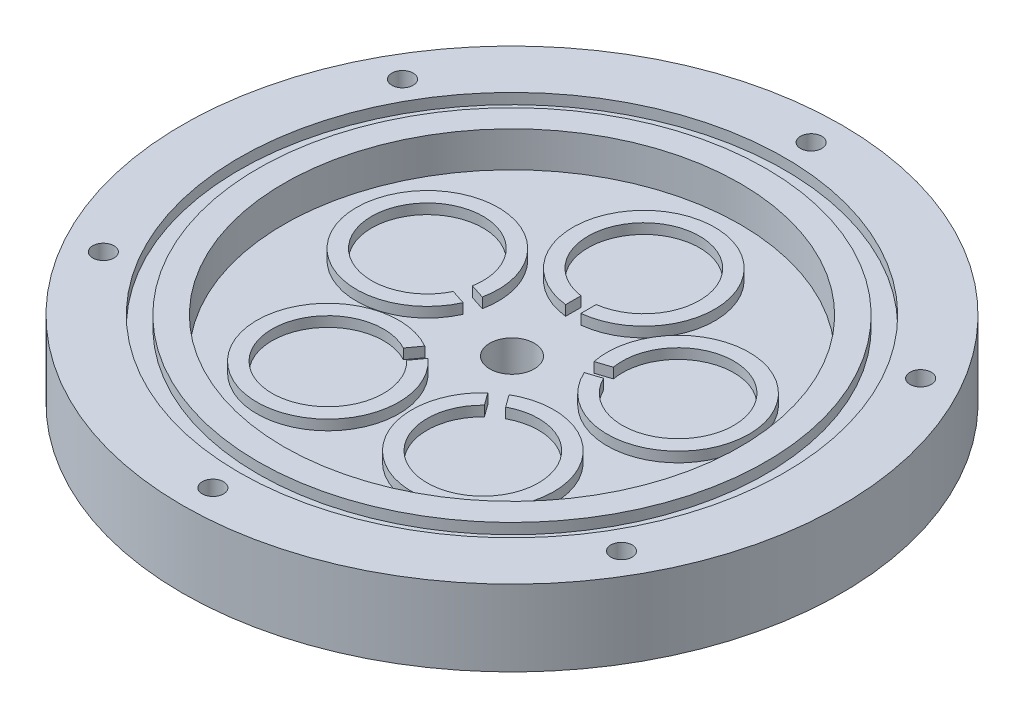
ISO-10303-21;
HEADER;
FILE_DESCRIPTION(('STEP AP214'),'2;1');
FILE_NAME('part.step','',(''),(''),'','','');
FILE_SCHEMA(('AUTOMOTIVE_DESIGN { 1 0 10303 214 1 1 1 1 }'));
ENDSEC;
DATA;
#1=APPLICATION_CONTEXT('core data for automotive mechanical design processes');
#2=APPLICATION_PROTOCOL_DEFINITION('international standard','automotive_design',2000,#1);
#3=PRODUCT_CONTEXT('',#1,'mechanical');
#4=PRODUCT('Part','Part','',(#3));
#5=PRODUCT_RELATED_PRODUCT_CATEGORY('part','',(#4));
#6=PRODUCT_DEFINITION_FORMATION('','',#4);
#7=PRODUCT_DEFINITION_CONTEXT('part definition',#1,'design');
#8=PRODUCT_DEFINITION('design','',#6,#7);
#9=PRODUCT_DEFINITION_SHAPE('','',#8);
#10=(LENGTH_UNIT() NAMED_UNIT(*) SI_UNIT(.MILLI.,.METRE.));
#11=(NAMED_UNIT(*) PLANE_ANGLE_UNIT() SI_UNIT($,.RADIAN.));
#12=(NAMED_UNIT(*) SI_UNIT($,.STERADIAN.) SOLID_ANGLE_UNIT());
#13=UNCERTAINTY_MEASURE_WITH_UNIT(LENGTH_MEASURE(1.E-05),#10,'distance_accuracy_value','');
#14=(GEOMETRIC_REPRESENTATION_CONTEXT(3) GLOBAL_UNCERTAINTY_ASSIGNED_CONTEXT((#13)) GLOBAL_UNIT_ASSIGNED_CONTEXT((#10,
#11,#12)) REPRESENTATION_CONTEXT('',''));
#15=CARTESIAN_POINT('',(0.,0.,0.));
#16=DIRECTION('',(0.,0.,1.));
#17=DIRECTION('',(1.,0.,0.));
#18=AXIS2_PLACEMENT_3D('',#15,#16,#17);
#19=CARTESIAN_POINT('',(0.,0.,0.));
#20=DIRECTION('',(0.,1.,0.));
#21=DIRECTION('',(0.,0.,1.));
#22=AXIS2_PLACEMENT_3D('',#19,#20,#21);
#23=PLANE('',#22);
#24=CARTESIAN_POINT('',(0.,0.,0.));
#25=DIRECTION('',(0.,1.,0.));
#26=DIRECTION('',(0.,0.,1.));
#27=AXIS2_PLACEMENT_3D('',#24,#25,#26);
#28=CIRCLE('',#27,50.095);
#29=CARTESIAN_POINT('',(0.,0.,50.095));
#30=VERTEX_POINT('',#29);
#31=EDGE_CURVE('E83',#30,#30,#28,.T.);
#32=ORIENTED_EDGE('',*,*,#31,.T.);
#33=EDGE_LOOP('',(#32));
#34=FACE_BOUND('',#33,.T.);
#35=CARTESIAN_POINT('',(0.,0.,0.));
#36=DIRECTION('',(0.,1.,0.));
#37=DIRECTION('',(0.,0.,1.));
#38=AXIS2_PLACEMENT_3D('',#35,#36,#37);
#39=CIRCLE('',#38,45.);
#40=CARTESIAN_POINT('',(0.,0.,45.));
#41=VERTEX_POINT('',#40);
#42=EDGE_CURVE('E352',#41,#41,#39,.T.);
#43=ORIENTED_EDGE('',*,*,#42,.F.);
#44=EDGE_LOOP('',(#43));
#45=FACE_BOUND('',#44,.T.);
#46=ADVANCED_FACE('F79',(#34,#45),#23,.T.);
#47=CARTESIAN_POINT('',(24.727469423674,-5.,-8.03444185374856));
#48=DIRECTION('',(0.,1.,0.));
#49=DIRECTION('',(-0.951056516295155,0.,0.309016994374945));
#50=AXIS2_PLACEMENT_3D('',#47,#48,#49);
#51=PLANE('',#50);
#52=CARTESIAN_POINT('',(24.727469423674,-5.,-8.03444185374856));
#53=DIRECTION('',(0.,1.,0.));
#54=DIRECTION('',(-0.951056516295155,0.,0.309016994374945));
#55=AXIS2_PLACEMENT_3D('',#52,#53,#54);
#56=CIRCLE('',#55,14.);
#57=CARTESIAN_POINT('',(11.9528484690729,-5.,-2.30652255733168));
#58=VERTEX_POINT('',#57);
#59=CARTESIAN_POINT('',(11.025797485948,-5.,-5.15969210621714));
#60=VERTEX_POINT('',#59);
#61=EDGE_CURVE('E300',#58,#60,#56,.T.);
#62=ORIENTED_EDGE('',*,*,#61,.T.);
#63=DIRECTION('',(0.951056516295154,0.,-0.309016994374945));
#64=VECTOR('',#63,1.);
#65=CARTESIAN_POINT('',(24.2639439321116,-5.,-9.4610266281913));
#66=LINE('',#65,#64);
#67=CARTESIAN_POINT('',(13.9000458217955,-5.,-6.09359200239864));
#68=VERTEX_POINT('',#67);
#69=EDGE_CURVE('E497',#60,#68,#66,.T.);
#70=ORIENTED_EDGE('',*,*,#69,.T.);
#71=CARTESIAN_POINT('',(24.727469423674,-5.,-8.03444185374856));
#72=DIRECTION('',(0.,1.,0.));
#73=DIRECTION('',(-0.951056516295155,0.,0.309016994374945));
#74=AXIS2_PLACEMENT_3D('',#71,#72,#73);
#75=CIRCLE('',#74,11.);
#76=CARTESIAN_POINT('',(14.8270968049204,-5.,-3.24042245351318));
#77=VERTEX_POINT('',#76);
#78=EDGE_CURVE('E307',#77,#68,#75,.T.);
#79=ORIENTED_EDGE('',*,*,#78,.F.);
#80=DIRECTION('',(-0.951056516295154,0.,0.309016994374945));
#81=VECTOR('',#80,1.);
#82=CARTESIAN_POINT('',(25.1909949152364,-5.,-6.60785707930583));
#83=LINE('',#82,#81);
#84=EDGE_CURVE('E530',#77,#58,#83,.T.);
#85=ORIENTED_EDGE('',*,*,#84,.T.);
#86=EDGE_LOOP('',(#62,#70,#79,#85));
#87=FACE_BOUND('',#86,.T.);
#88=ADVANCED_FACE('F697',(#87),#51,.T.);
#89=CARTESIAN_POINT('',(24.727469423674,-5.,-8.03444185374856));
#90=DIRECTION('',(0.,-1.,0.));
#91=DIRECTION('',(0.,0.,-1.));
#92=AXIS2_PLACEMENT_3D('',#89,#90,#91);
#93=CYLINDRICAL_SURFACE('',#92,14.);
#94=DIRECTION('',(0.,-1.,0.));
#95=VECTOR('',#94,1.);
#96=CARTESIAN_POINT('',(11.025797485948,-5.,-5.15969210621714));
#97=LINE('',#96,#95);
#98=CARTESIAN_POINT('',(11.025797485948,-7.,-5.15969210621714));
#99=VERTEX_POINT('',#98);
#100=EDGE_CURVE('E261',#60,#99,#97,.T.);
#101=ORIENTED_EDGE('',*,*,#100,.F.);
#102=ORIENTED_EDGE('',*,*,#61,.F.);
#103=DIRECTION('',(0.,-1.,0.));
#104=VECTOR('',#103,1.);
#105=CARTESIAN_POINT('',(11.9528484690729,-5.,-2.30652255733168));
#106=LINE('',#105,#104);
#107=CARTESIAN_POINT('',(11.9528484690729,-7.,-2.30652255733167));
#108=VERTEX_POINT('',#107);
#109=EDGE_CURVE('E532',#108,#58,#106,.F.);
#110=ORIENTED_EDGE('',*,*,#109,.F.);
#111=CARTESIAN_POINT('',(24.727469423674,-7.,-8.03444185374856));
#112=DIRECTION('',(0.,1.,0.));
#113=DIRECTION('',(-0.951056516295155,0.,0.309016994374945));
#114=AXIS2_PLACEMENT_3D('',#111,#112,#113);
#115=CIRCLE('',#114,14.);
#116=EDGE_CURVE('E306',#108,#99,#115,.T.);
#117=ORIENTED_EDGE('',*,*,#116,.T.);
#118=EDGE_LOOP('',(#101,#102,#110,#117));
#119=FACE_BOUND('',#118,.T.);
#120=ADVANCED_FACE('F702',(#119),#93,.T.);
#121=CARTESIAN_POINT('',(24.727469423674,-5.,-8.03444185374856));
#122=DIRECTION('',(0.,-1.,0.));
#123=DIRECTION('',(0.,0.,-1.));
#124=AXIS2_PLACEMENT_3D('',#121,#122,#123);
#125=CYLINDRICAL_SURFACE('',#124,11.);
#126=ORIENTED_EDGE('',*,*,#78,.T.);
#127=DIRECTION('',(0.,-1.,0.));
#128=VECTOR('',#127,1.);
#129=CARTESIAN_POINT('',(13.9000458217955,-5.,-6.09359200239864));
#130=LINE('',#129,#128);
#131=CARTESIAN_POINT('',(13.9000458217955,-7.,-6.09359200239864));
#132=VERTEX_POINT('',#131);
#133=EDGE_CURVE('E527',#68,#132,#130,.T.);
#134=ORIENTED_EDGE('',*,*,#133,.T.);
#135=CARTESIAN_POINT('',(24.727469423674,-7.,-8.03444185374856));
#136=DIRECTION('',(0.,1.,0.));
#137=DIRECTION('',(0.,0.,1.));
#138=AXIS2_PLACEMENT_3D('',#135,#136,#137);
#139=CIRCLE('',#138,11.);
#140=CARTESIAN_POINT('',(14.8270968049204,-7.,-3.24042245351318));
#141=VERTEX_POINT('',#140);
#142=EDGE_CURVE('E523',#132,#141,#139,.F.);
#143=ORIENTED_EDGE('',*,*,#142,.T.);
#144=DIRECTION('',(0.,-1.,0.));
#145=VECTOR('',#144,1.);
#146=CARTESIAN_POINT('',(14.8270968049204,-5.,-3.24042245351318));
#147=LINE('',#146,#145);
#148=EDGE_CURVE('E485',#141,#77,#147,.F.);
#149=ORIENTED_EDGE('',*,*,#148,.T.);
#150=EDGE_LOOP('',(#126,#134,#143,#149));
#151=FACE_BOUND('',#150,.T.);
#152=ADVANCED_FACE('F764',(#151),#125,.F.);
#153=CARTESIAN_POINT('',(15.2824165596042,-5.,21.0344418537487));
#154=DIRECTION('',(0.,1.,0.));
#155=DIRECTION('',(-0.587785252292469,0.,-0.809016994374951));
#156=AXIS2_PLACEMENT_3D('',#153,#154,#155);
#157=PLANE('',#156);
#158=CARTESIAN_POINT('',(15.2824165596042,-5.,21.0344418537487));
#159=DIRECTION('',(0.,1.,0.));
#160=DIRECTION('',(-0.587785252292469,0.,-0.809016994374951));
#161=AXIS2_PLACEMENT_3D('',#158,#159,#160);
#162=CIRCLE('',#161,14.);
#163=CARTESIAN_POINT('',(5.8872666162641,-5.,10.6550797566757));
#164=VERTEX_POINT('',#163);
#165=CARTESIAN_POINT('',(8.31431759938896,-5.,8.89172399979824));
#166=VERTEX_POINT('',#165);
#167=EDGE_CURVE('E459',#164,#166,#162,.T.);
#168=ORIENTED_EDGE('',*,*,#167,.T.);
#169=DIRECTION('',(0.587785252292469,0.,0.809016994374951));
#170=VECTOR('',#169,1.);
#171=CARTESIAN_POINT('',(16.4959420511666,-5.,20.15276397531));
#172=LINE('',#171,#170);
#173=CARTESIAN_POINT('',(10.0907007630505,-5.,11.3367056700915));
#174=VERTEX_POINT('',#173);
#175=EDGE_CURVE('E472',#166,#174,#172,.T.);
#176=ORIENTED_EDGE('',*,*,#175,.T.);
#177=CARTESIAN_POINT('',(15.2824165596042,-5.,21.0344418537487));
#178=DIRECTION('',(0.,1.,0.));
#179=DIRECTION('',(-0.587785252292469,0.,-0.809016994374951));
#180=AXIS2_PLACEMENT_3D('',#177,#178,#179);
#181=CIRCLE('',#180,11.);
#182=CARTESIAN_POINT('',(7.66364977992568,-5.,13.1000614269689));
#183=VERTEX_POINT('',#182);
#184=EDGE_CURVE('E460',#183,#174,#181,.T.);
#185=ORIENTED_EDGE('',*,*,#184,.F.);
#186=DIRECTION('',(-0.587785252292469,0.,-0.809016994374951));
#187=VECTOR('',#186,1.);
#188=CARTESIAN_POINT('',(14.0688910680418,-5.,21.9161197321874));
#189=LINE('',#188,#187);
#190=EDGE_CURVE('E582',#183,#164,#189,.T.);
#191=ORIENTED_EDGE('',*,*,#190,.T.);
#192=EDGE_LOOP('',(#168,#176,#185,#191));
#193=FACE_BOUND('',#192,.T.);
#194=ADVANCED_FACE('F635',(#193),#157,.T.);
#195=CARTESIAN_POINT('',(15.2824165596042,-5.,21.0344418537487));
#196=DIRECTION('',(0.,-1.,0.));
#197=DIRECTION('',(0.,0.,-1.));
#198=AXIS2_PLACEMENT_3D('',#195,#196,#197);
#199=CYLINDRICAL_SURFACE('',#198,14.);
#200=DIRECTION('',(0.,-1.,0.));
#201=VECTOR('',#200,1.);
#202=CARTESIAN_POINT('',(8.31431759938896,-5.,8.89172399979825));
#203=LINE('',#202,#201);
#204=CARTESIAN_POINT('',(8.31431759938896,-7.,8.89172399979825));
#205=VERTEX_POINT('',#204);
#206=EDGE_CURVE('E478',#166,#205,#203,.T.);
#207=ORIENTED_EDGE('',*,*,#206,.F.);
#208=ORIENTED_EDGE('',*,*,#167,.F.);
#209=DIRECTION('',(0.,-1.,0.));
#210=VECTOR('',#209,1.);
#211=CARTESIAN_POINT('',(5.88726661626411,-5.,10.6550797566757));
#212=LINE('',#211,#210);
#213=CARTESIAN_POINT('',(5.88726661626411,-7.,10.6550797566757));
#214=VERTEX_POINT('',#213);
#215=EDGE_CURVE('E580',#214,#164,#212,.F.);
#216=ORIENTED_EDGE('',*,*,#215,.F.);
#217=CARTESIAN_POINT('',(15.2824165596042,-7.,21.0344418537487));
#218=DIRECTION('',(0.,1.,0.));
#219=DIRECTION('',(-0.587785252292469,0.,-0.809016994374951));
#220=AXIS2_PLACEMENT_3D('',#217,#218,#219);
#221=CIRCLE('',#220,14.);
#222=EDGE_CURVE('E454',#214,#205,#221,.T.);
#223=ORIENTED_EDGE('',*,*,#222,.T.);
#224=EDGE_LOOP('',(#207,#208,#216,#223));
#225=FACE_BOUND('',#224,.T.);
#226=ADVANCED_FACE('F640',(#225),#199,.T.);
#227=CARTESIAN_POINT('',(15.2824165596042,-5.,21.0344418537487));
#228=DIRECTION('',(0.,-1.,0.));
#229=DIRECTION('',(0.,0.,-1.));
#230=AXIS2_PLACEMENT_3D('',#227,#228,#229);
#231=CYLINDRICAL_SURFACE('',#230,11.);
#232=ORIENTED_EDGE('',*,*,#184,.T.);
#233=DIRECTION('',(0.,-1.,0.));
#234=VECTOR('',#233,1.);
#235=CARTESIAN_POINT('',(10.0907007630505,-5.,11.3367056700915));
#236=LINE('',#235,#234);
#237=CARTESIAN_POINT('',(10.0907007630505,-7.,11.3367056700915));
#238=VERTEX_POINT('',#237);
#239=EDGE_CURVE('E479',#174,#238,#236,.T.);
#240=ORIENTED_EDGE('',*,*,#239,.T.);
#241=CARTESIAN_POINT('',(15.2824165596042,-7.,21.0344418537487));
#242=DIRECTION('',(0.,1.,0.));
#243=DIRECTION('',(0.,0.,1.));
#244=AXIS2_PLACEMENT_3D('',#241,#242,#243);
#245=CIRCLE('',#244,11.);
#246=CARTESIAN_POINT('',(7.66364977992568,-7.,13.1000614269689));
#247=VERTEX_POINT('',#246);
#248=EDGE_CURVE('E646',#238,#247,#245,.F.);
#249=ORIENTED_EDGE('',*,*,#248,.T.);
#250=DIRECTION('',(0.,-1.,0.));
#251=VECTOR('',#250,1.);
#252=CARTESIAN_POINT('',(7.66364977992568,-5.,13.1000614269689));
#253=LINE('',#252,#251);
#254=EDGE_CURVE('E583',#247,#183,#253,.F.);
#255=ORIENTED_EDGE('',*,*,#254,.T.);
#256=EDGE_LOOP('',(#232,#240,#249,#255));
#257=FACE_BOUND('',#256,.T.);
#258=ADVANCED_FACE('F772',(#257),#231,.F.);
#259=CARTESIAN_POINT('',(-15.2824165596045,-5.,21.0344418537485));
#260=DIRECTION('',(0.,1.,0.));
#261=DIRECTION('',(0.58778525229248,0.,-0.809016994374942));
#262=AXIS2_PLACEMENT_3D('',#259,#260,#261);
#263=PLANE('',#262);
#264=CARTESIAN_POINT('',(-15.2824165596045,-5.,21.0344418537485));
#265=DIRECTION('',(0.,1.,0.));
#266=DIRECTION('',(0.58778525229248,0.,-0.809016994374942));
#267=AXIS2_PLACEMENT_3D('',#264,#265,#266);
#268=CIRCLE('',#267,14.);
#269=CARTESIAN_POINT('',(-8.31431759938909,-5.,8.89172399979812));
#270=VERTEX_POINT('',#269);
#271=CARTESIAN_POINT('',(-5.88726661626426,-5.,10.6550797566756));
#272=VERTEX_POINT('',#271);
#273=EDGE_CURVE('E608',#270,#272,#268,.T.);
#274=ORIENTED_EDGE('',*,*,#273,.T.);
#275=DIRECTION('',(-0.58778525229248,0.,0.809016994374942));
#276=VECTOR('',#275,1.);
#277=CARTESIAN_POINT('',(-14.0688910680421,-5.,21.9161197321872));
#278=LINE('',#277,#276);
#279=CARTESIAN_POINT('',(-7.66364977992587,-5.,13.1000614269688));
#280=VERTEX_POINT('',#279);
#281=EDGE_CURVE('E589',#272,#280,#278,.T.);
#282=ORIENTED_EDGE('',*,*,#281,.T.);
#283=CARTESIAN_POINT('',(-15.2824165596045,-5.,21.0344418537485));
#284=DIRECTION('',(0.,1.,0.));
#285=DIRECTION('',(0.58778525229248,0.,-0.809016994374942));
#286=AXIS2_PLACEMENT_3D('',#283,#284,#285);
#287=CIRCLE('',#286,11.);
#288=CARTESIAN_POINT('',(-10.0907007630507,-5.,11.3367056700913));
#289=VERTEX_POINT('',#288);
#290=EDGE_CURVE('E257',#289,#280,#287,.T.);
#291=ORIENTED_EDGE('',*,*,#290,.F.);
#292=DIRECTION('',(0.58778525229248,0.,-0.809016994374942));
#293=VECTOR('',#292,1.);
#294=CARTESIAN_POINT('',(-16.4959420511669,-5.,20.1527639753098));
#295=LINE('',#294,#293);
#296=EDGE_CURVE('E441',#289,#270,#295,.T.);
#297=ORIENTED_EDGE('',*,*,#296,.T.);
#298=EDGE_LOOP('',(#274,#282,#291,#297));
#299=FACE_BOUND('',#298,.T.);
#300=ADVANCED_FACE('F606',(#299),#263,.T.);
#301=CARTESIAN_POINT('',(-15.2824165596045,-5.,21.0344418537485));
#302=DIRECTION('',(0.,-1.,0.));
#303=DIRECTION('',(0.,0.,-1.));
#304=AXIS2_PLACEMENT_3D('',#301,#302,#303);
#305=CYLINDRICAL_SURFACE('',#304,14.);
#306=DIRECTION('',(0.,-1.,0.));
#307=VECTOR('',#306,1.);
#308=CARTESIAN_POINT('',(-5.88726661626426,-5.,10.6550797566756));
#309=LINE('',#308,#307);
#310=CARTESIAN_POINT('',(-5.88726661626426,-7.,10.6550797566756));
#311=VERTEX_POINT('',#310);
#312=EDGE_CURVE('E586',#272,#311,#309,.T.);
#313=ORIENTED_EDGE('',*,*,#312,.F.);
#314=ORIENTED_EDGE('',*,*,#273,.F.);
#315=DIRECTION('',(0.,-1.,0.));
#316=VECTOR('',#315,1.);
#317=CARTESIAN_POINT('',(-8.31431759938909,-5.,8.89172399979813));
#318=LINE('',#317,#316);
#319=CARTESIAN_POINT('',(-8.31431759938909,-7.,8.89172399979813));
#320=VERTEX_POINT('',#319);
#321=EDGE_CURVE('E446',#320,#270,#318,.F.);
#322=ORIENTED_EDGE('',*,*,#321,.F.);
#323=CARTESIAN_POINT('',(-15.2824165596045,-7.,21.0344418537485));
#324=DIRECTION('',(0.,1.,0.));
#325=DIRECTION('',(0.58778525229248,0.,-0.809016994374942));
#326=AXIS2_PLACEMENT_3D('',#323,#324,#325);
#327=CIRCLE('',#326,14.);
#328=EDGE_CURVE('E613',#320,#311,#327,.T.);
#329=ORIENTED_EDGE('',*,*,#328,.T.);
#330=EDGE_LOOP('',(#313,#314,#322,#329));
#331=FACE_BOUND('',#330,.T.);
#332=ADVANCED_FACE('F611',(#331),#305,.T.);
#333=CARTESIAN_POINT('',(-15.2824165596045,-5.,21.0344418537485));
#334=DIRECTION('',(0.,-1.,0.));
#335=DIRECTION('',(0.,0.,-1.));
#336=AXIS2_PLACEMENT_3D('',#333,#334,#335);
#337=CYLINDRICAL_SURFACE('',#336,11.);
#338=ORIENTED_EDGE('',*,*,#290,.T.);
#339=DIRECTION('',(0.,-1.,0.));
#340=VECTOR('',#339,1.);
#341=CARTESIAN_POINT('',(-7.66364977992587,-5.,13.1000614269688));
#342=LINE('',#341,#340);
#343=CARTESIAN_POINT('',(-7.66364977992587,-7.,13.1000614269688));
#344=VERTEX_POINT('',#343);
#345=EDGE_CURVE('E591',#280,#344,#342,.T.);
#346=ORIENTED_EDGE('',*,*,#345,.T.);
#347=CARTESIAN_POINT('',(-15.2824165596045,-7.,21.0344418537485));
#348=DIRECTION('',(0.,1.,0.));
#349=DIRECTION('',(0.,0.,1.));
#350=AXIS2_PLACEMENT_3D('',#347,#348,#349);
#351=CIRCLE('',#350,11.);
#352=CARTESIAN_POINT('',(-10.0907007630507,-7.,11.3367056700913));
#353=VERTEX_POINT('',#352);
#354=EDGE_CURVE('E90',#344,#353,#351,.F.);
#355=ORIENTED_EDGE('',*,*,#354,.T.);
#356=DIRECTION('',(0.,-1.,0.));
#357=VECTOR('',#356,1.);
#358=CARTESIAN_POINT('',(-10.0907007630507,-5.,11.3367056700913));
#359=LINE('',#358,#357);
#360=EDGE_CURVE('E435',#353,#289,#359,.F.);
#361=ORIENTED_EDGE('',*,*,#360,.T.);
#362=EDGE_LOOP('',(#338,#346,#355,#361));
#363=FACE_BOUND('',#362,.T.);
#364=ADVANCED_FACE('F662',(#363),#337,.F.);
#365=CARTESIAN_POINT('',(-24.7274694236739,-5.,-8.03444185374891));
#366=DIRECTION('',(0.,1.,0.));
#367=DIRECTION('',(0.95105651629515,0.,0.309016994374958));
#368=AXIS2_PLACEMENT_3D('',#365,#366,#367);
#369=PLANE('',#368);
#370=CARTESIAN_POINT('',(-24.7274694236739,-5.,-8.03444185374891));
#371=DIRECTION('',(0.,1.,0.));
#372=DIRECTION('',(0.95105651629515,0.,0.309016994374958));
#373=AXIS2_PLACEMENT_3D('',#370,#371,#372);
#374=CIRCLE('',#373,14.);
#375=CARTESIAN_POINT('',(-11.0257974859479,-5.,-5.1596921062173));
#376=VERTEX_POINT('',#375);
#377=CARTESIAN_POINT('',(-11.9528484690728,-5.,-2.30652255733185));
#378=VERTEX_POINT('',#377);
#379=EDGE_CURVE('E242',#376,#378,#374,.T.);
#380=ORIENTED_EDGE('',*,*,#379,.T.);
#381=DIRECTION('',(-0.95105651629515,0.,-0.309016994374958));
#382=VECTOR('',#381,1.);
#383=CARTESIAN_POINT('',(-25.1909949152363,-5.,-6.60785707930619));
#384=LINE('',#383,#382);
#385=CARTESIAN_POINT('',(-14.8270968049203,-5.,-3.24042245351339));
#386=VERTEX_POINT('',#385);
#387=EDGE_CURVE('E436',#378,#386,#384,.T.);
#388=ORIENTED_EDGE('',*,*,#387,.T.);
#389=CARTESIAN_POINT('',(-24.7274694236739,-5.,-8.03444185374891));
#390=DIRECTION('',(0.,1.,0.));
#391=DIRECTION('',(0.95105651629515,0.,0.309016994374958));
#392=AXIS2_PLACEMENT_3D('',#389,#390,#391);
#393=CIRCLE('',#392,11.);
#394=CARTESIAN_POINT('',(-13.9000458217955,-5.,-6.09359200239884));
#395=VERTEX_POINT('',#394);
#396=EDGE_CURVE('E252',#395,#386,#393,.T.);
#397=ORIENTED_EDGE('',*,*,#396,.F.);
#398=DIRECTION('',(0.95105651629515,0.,0.309016994374958));
#399=VECTOR('',#398,1.);
#400=CARTESIAN_POINT('',(-24.2639439321115,-5.,-9.46102662819164));
#401=LINE('',#400,#399);
#402=EDGE_CURVE('E245',#395,#376,#401,.T.);
#403=ORIENTED_EDGE('',*,*,#402,.T.);
#404=EDGE_LOOP('',(#380,#388,#397,#403));
#405=FACE_BOUND('',#404,.T.);
#406=ADVANCED_FACE('F517',(#405),#369,.T.);
#407=CARTESIAN_POINT('',(-24.7274694236739,-5.,-8.03444185374891));
#408=DIRECTION('',(0.,-1.,0.));
#409=DIRECTION('',(0.,0.,-1.));
#410=AXIS2_PLACEMENT_3D('',#407,#408,#409);
#411=CYLINDRICAL_SURFACE('',#410,14.);
#412=DIRECTION('',(0.,-1.,0.));
#413=VECTOR('',#412,1.);
#414=CARTESIAN_POINT('',(-11.9528484690728,-5.,-2.30652255733185));
#415=LINE('',#414,#413);
#416=CARTESIAN_POINT('',(-11.9528484690728,-7.,-2.30652255733185));
#417=VERTEX_POINT('',#416);
#418=EDGE_CURVE('E430',#378,#417,#415,.T.);
#419=ORIENTED_EDGE('',*,*,#418,.F.);
#420=ORIENTED_EDGE('',*,*,#379,.F.);
#421=DIRECTION('',(0.,-1.,0.));
#422=VECTOR('',#421,1.);
#423=CARTESIAN_POINT('',(-11.0257974859479,-5.,-5.1596921062173));
#424=LINE('',#423,#422);
#425=CARTESIAN_POINT('',(-11.0257974859479,-7.,-5.1596921062173));
#426=VERTEX_POINT('',#425);
#427=EDGE_CURVE('E224',#426,#376,#424,.F.);
#428=ORIENTED_EDGE('',*,*,#427,.F.);
#429=CARTESIAN_POINT('',(-24.7274694236739,-7.,-8.03444185374891));
#430=DIRECTION('',(0.,1.,0.));
#431=DIRECTION('',(0.95105651629515,0.,0.309016994374958));
#432=AXIS2_PLACEMENT_3D('',#429,#430,#431);
#433=CIRCLE('',#432,14.);
#434=EDGE_CURVE('E240',#426,#417,#433,.T.);
#435=ORIENTED_EDGE('',*,*,#434,.T.);
#436=EDGE_LOOP('',(#419,#420,#428,#435));
#437=FACE_BOUND('',#436,.T.);
#438=ADVANCED_FACE('F239',(#437),#411,.T.);
#439=CARTESIAN_POINT('',(-24.7274694236739,-5.,-8.03444185374891));
#440=DIRECTION('',(0.,-1.,0.));
#441=DIRECTION('',(0.,0.,-1.));
#442=AXIS2_PLACEMENT_3D('',#439,#440,#441);
#443=CYLINDRICAL_SURFACE('',#442,11.);
#444=ORIENTED_EDGE('',*,*,#396,.T.);
#445=DIRECTION('',(0.,-1.,0.));
#446=VECTOR('',#445,1.);
#447=CARTESIAN_POINT('',(-14.8270968049203,-5.,-3.24042245351339));
#448=LINE('',#447,#446);
#449=CARTESIAN_POINT('',(-14.8270968049203,-7.,-3.24042245351339));
#450=VERTEX_POINT('',#449);
#451=EDGE_CURVE('E244',#386,#450,#448,.T.);
#452=ORIENTED_EDGE('',*,*,#451,.T.);
#453=CARTESIAN_POINT('',(-24.7274694236739,-7.,-8.03444185374891));
#454=DIRECTION('',(0.,1.,0.));
#455=DIRECTION('',(0.,0.,1.));
#456=AXIS2_PLACEMENT_3D('',#453,#454,#455);
#457=CIRCLE('',#456,11.);
#458=CARTESIAN_POINT('',(-13.9000458217955,-7.,-6.09359200239884));
#459=VERTEX_POINT('',#458);
#460=EDGE_CURVE('E13',#450,#459,#457,.F.);
#461=ORIENTED_EDGE('',*,*,#460,.T.);
#462=DIRECTION('',(0.,-1.,0.));
#463=VECTOR('',#462,1.);
#464=CARTESIAN_POINT('',(-13.9000458217955,-5.,-6.09359200239884));
#465=LINE('',#464,#463);
#466=EDGE_CURVE('E227',#459,#395,#465,.F.);
#467=ORIENTED_EDGE('',*,*,#466,.T.);
#468=EDGE_LOOP('',(#444,#452,#461,#467));
#469=FACE_BOUND('',#468,.T.);
#470=ADVANCED_FACE('F519',(#469),#443,.F.);
#471=CARTESIAN_POINT('',(0.,-5.,-26.));
#472=DIRECTION('',(0.,1.,0.));
#473=DIRECTION('',(0.,0.,1.));
#474=AXIS2_PLACEMENT_3D('',#471,#472,#473);
#475=PLANE('',#474);
#476=CARTESIAN_POINT('',(0.,-5.,-26.));
#477=DIRECTION('',(0.,1.,0.));
#478=DIRECTION('',(0.,0.,1.));
#479=AXIS2_PLACEMENT_3D('',#476,#477,#478);
#480=CIRCLE('',#479,14.);
#481=CARTESIAN_POINT('',(1.5,-5.,-12.0805890929249));
#482=VERTEX_POINT('',#481);
#483=CARTESIAN_POINT('',(-1.5,-5.,-12.0805890929249));
#484=VERTEX_POINT('',#483);
#485=EDGE_CURVE('E331',#482,#484,#480,.T.);
#486=ORIENTED_EDGE('',*,*,#485,.T.);
#487=DIRECTION('',(0.,0.,-1.));
#488=VECTOR('',#487,1.);
#489=CARTESIAN_POINT('',(-1.5,-5.,-26.));
#490=LINE('',#489,#488);
#491=CARTESIAN_POINT('',(-1.5,-5.,-15.1027526411483));
#492=VERTEX_POINT('',#491);
#493=EDGE_CURVE('E541',#484,#492,#490,.T.);
#494=ORIENTED_EDGE('',*,*,#493,.T.);
#495=CARTESIAN_POINT('',(0.,-5.,-26.));
#496=DIRECTION('',(0.,1.,0.));
#497=DIRECTION('',(0.,0.,1.));
#498=AXIS2_PLACEMENT_3D('',#495,#496,#497);
#499=CIRCLE('',#498,11.);
#500=CARTESIAN_POINT('',(1.5,-5.,-15.1027526411483));
#501=VERTEX_POINT('',#500);
#502=EDGE_CURVE('E338',#501,#492,#499,.T.);
#503=ORIENTED_EDGE('',*,*,#502,.F.);
#504=DIRECTION('',(0.,0.,1.));
#505=VECTOR('',#504,1.);
#506=CARTESIAN_POINT('',(1.5,-5.,-26.));
#507=LINE('',#506,#505);
#508=EDGE_CURVE('E548',#501,#482,#507,.T.);
#509=ORIENTED_EDGE('',*,*,#508,.T.);
#510=EDGE_LOOP('',(#486,#494,#503,#509));
#511=FACE_BOUND('',#510,.T.);
#512=ADVANCED_FACE('F751',(#511),#475,.T.);
#513=CARTESIAN_POINT('',(0.,-5.,-26.));
#514=DIRECTION('',(0.,-1.,0.));
#515=DIRECTION('',(0.,0.,-1.));
#516=AXIS2_PLACEMENT_3D('',#513,#514,#515);
#517=CYLINDRICAL_SURFACE('',#516,14.);
#518=DIRECTION('',(0.,-1.,0.));
#519=VECTOR('',#518,1.);
#520=CARTESIAN_POINT('',(-1.5,-5.,-12.0805890929249));
#521=LINE('',#520,#519);
#522=CARTESIAN_POINT('',(-1.5,-7.,-12.0805890929249));
#523=VERTEX_POINT('',#522);
#524=EDGE_CURVE('E544',#484,#523,#521,.T.);
#525=ORIENTED_EDGE('',*,*,#524,.F.);
#526=ORIENTED_EDGE('',*,*,#485,.F.);
#527=DIRECTION('',(0.,-1.,0.));
#528=VECTOR('',#527,1.);
#529=CARTESIAN_POINT('',(1.5,-5.,-12.0805890929249));
#530=LINE('',#529,#528);
#531=CARTESIAN_POINT('',(1.5,-7.,-12.0805890929249));
#532=VERTEX_POINT('',#531);
#533=EDGE_CURVE('E551',#532,#482,#530,.F.);
#534=ORIENTED_EDGE('',*,*,#533,.F.);
#535=CARTESIAN_POINT('',(0.,-7.,-26.));
#536=DIRECTION('',(0.,1.,0.));
#537=DIRECTION('',(0.,0.,1.));
#538=AXIS2_PLACEMENT_3D('',#535,#536,#537);
#539=CIRCLE('',#538,14.);
#540=EDGE_CURVE('E337',#532,#523,#539,.T.);
#541=ORIENTED_EDGE('',*,*,#540,.T.);
#542=EDGE_LOOP('',(#525,#526,#534,#541));
#543=FACE_BOUND('',#542,.T.);
#544=ADVANCED_FACE('F748',(#543),#517,.T.);
#545=CARTESIAN_POINT('',(0.,-5.,-26.));
#546=DIRECTION('',(0.,-1.,0.));
#547=DIRECTION('',(0.,0.,-1.));
#548=AXIS2_PLACEMENT_3D('',#545,#546,#547);
#549=CYLINDRICAL_SURFACE('',#548,11.);
#550=ORIENTED_EDGE('',*,*,#502,.T.);
#551=DIRECTION('',(0.,-1.,0.));
#552=VECTOR('',#551,1.);
#553=CARTESIAN_POINT('',(-1.5,-5.,-15.1027526411483));
#554=LINE('',#553,#552);
#555=CARTESIAN_POINT('',(-1.5,-7.,-15.1027526411483));
#556=VERTEX_POINT('',#555);
#557=EDGE_CURVE('E545',#492,#556,#554,.T.);
#558=ORIENTED_EDGE('',*,*,#557,.T.);
#559=CARTESIAN_POINT('',(0.,-7.,-26.));
#560=DIRECTION('',(0.,1.,0.));
#561=DIRECTION('',(0.,0.,1.));
#562=AXIS2_PLACEMENT_3D('',#559,#560,#561);
#563=CIRCLE('',#562,11.);
#564=CARTESIAN_POINT('',(1.5,-7.,-15.1027526411483));
#565=VERTEX_POINT('',#564);
#566=EDGE_CURVE('E534',#556,#565,#563,.F.);
#567=ORIENTED_EDGE('',*,*,#566,.T.);
#568=DIRECTION('',(0.,-1.,0.));
#569=VECTOR('',#568,1.);
#570=CARTESIAN_POINT('',(1.5,-5.,-15.1027526411483));
#571=LINE('',#570,#569);
#572=EDGE_CURVE('E539',#565,#501,#571,.F.);
#573=ORIENTED_EDGE('',*,*,#572,.T.);
#574=EDGE_LOOP('',(#550,#558,#567,#573));
#575=FACE_BOUND('',#574,.T.);
#576=ADVANCED_FACE('F712',(#575),#549,.F.);
#577=CARTESIAN_POINT('',(0.,-15.,0.));
#578=DIRECTION('',(0.,1.,0.));
#579=DIRECTION('',(0.,0.,1.));
#580=AXIS2_PLACEMENT_3D('',#577,#578,#579);
#581=CYLINDRICAL_SURFACE('',#580,65.);
#582=CARTESIAN_POINT('',(0.,-15.,0.));
#583=DIRECTION('',(0.,1.,0.));
#584=DIRECTION('',(0.,0.,1.));
#585=AXIS2_PLACEMENT_3D('',#582,#583,#584);
#586=CIRCLE('',#585,65.);
#587=CARTESIAN_POINT('',(0.,-15.,65.));
#588=VERTEX_POINT('',#587);
#589=EDGE_CURVE('E537',#588,#588,#586,.T.);
#590=ORIENTED_EDGE('',*,*,#589,.T.);
#591=EDGE_LOOP('',(#590));
#592=FACE_BOUND('',#591,.T.);
#593=CARTESIAN_POINT('',(0.,0.,0.));
#594=DIRECTION('',(0.,1.,0.));
#595=DIRECTION('',(0.,0.,1.));
#596=AXIS2_PLACEMENT_3D('',#593,#594,#595);
#597=CIRCLE('',#596,65.);
#598=CARTESIAN_POINT('',(0.,0.,65.));
#599=VERTEX_POINT('',#598);
#600=EDGE_CURVE('E561',#599,#599,#597,.T.);
#601=ORIENTED_EDGE('',*,*,#600,.F.);
#602=EDGE_LOOP('',(#601));
#603=FACE_BOUND('',#602,.T.);
#604=ADVANCED_FACE('F81',(#592,#603),#581,.T.);
#605=CARTESIAN_POINT('',(0.,-15.,0.));
#606=DIRECTION('',(0.,1.,0.));
#607=DIRECTION('',(0.,0.,1.));
#608=AXIS2_PLACEMENT_3D('',#605,#606,#607);
#609=PLANE('',#608);
#610=CARTESIAN_POINT('',(-51.0954988232815,-15.,-29.5000000000006));
#611=DIRECTION('',(0.,1.,0.));
#612=DIRECTION('',(0.,0.,1.));
#613=AXIS2_PLACEMENT_3D('',#610,#611,#612);
#614=CIRCLE('',#613,2.1);
#615=CARTESIAN_POINT('',(-51.0954988232815,-15.,-27.4000000000006));
#616=VERTEX_POINT('',#615);
#617=EDGE_CURVE('E717',#616,#616,#614,.T.);
#618=ORIENTED_EDGE('',*,*,#617,.T.);
#619=EDGE_LOOP('',(#618));
#620=FACE_BOUND('',#619,.T.);
#621=CARTESIAN_POINT('',(-51.0954988232822,-15.,29.4999999999995));
#622=DIRECTION('',(0.,1.,0.));
#623=DIRECTION('',(0.,0.,1.));
#624=AXIS2_PLACEMENT_3D('',#621,#622,#623);
#625=CIRCLE('',#624,2.1);
#626=CARTESIAN_POINT('',(-51.0954988232822,-15.,31.5999999999995));
#627=VERTEX_POINT('',#626);
#628=EDGE_CURVE('E391',#627,#627,#625,.T.);
#629=ORIENTED_EDGE('',*,*,#628,.T.);
#630=EDGE_LOOP('',(#629));
#631=FACE_BOUND('',#630,.T.);
#632=CARTESIAN_POINT('',(0.,-15.,59.));
#633=DIRECTION('',(0.,1.,0.));
#634=DIRECTION('',(0.,0.,1.));
#635=AXIS2_PLACEMENT_3D('',#632,#633,#634);
#636=CIRCLE('',#635,2.1);
#637=CARTESIAN_POINT('',(0.,-15.,61.1));
#638=VERTEX_POINT('',#637);
#639=EDGE_CURVE('E367',#638,#638,#636,.T.);
#640=ORIENTED_EDGE('',*,*,#639,.T.);
#641=EDGE_LOOP('',(#640));
#642=FACE_BOUND('',#641,.T.);
#643=CARTESIAN_POINT('',(51.0954988232818,-15.,29.5000000000002));
#644=DIRECTION('',(0.,1.,0.));
#645=DIRECTION('',(0.,0.,1.));
#646=AXIS2_PLACEMENT_3D('',#643,#644,#645);
#647=CIRCLE('',#646,2.1);
#648=CARTESIAN_POINT('',(51.0954988232818,-15.,31.6000000000002));
#649=VERTEX_POINT('',#648);
#650=EDGE_CURVE('E366',#649,#649,#647,.T.);
#651=ORIENTED_EDGE('',*,*,#650,.T.);
#652=EDGE_LOOP('',(#651));
#653=FACE_BOUND('',#652,.T.);
#654=CARTESIAN_POINT('',(51.095498823282,-15.,-29.4999999999999));
#655=DIRECTION('',(0.,1.,0.));
#656=DIRECTION('',(0.,0.,1.));
#657=AXIS2_PLACEMENT_3D('',#654,#655,#656);
#658=CIRCLE('',#657,2.1);
#659=CARTESIAN_POINT('',(51.095498823282,-15.,-27.3999999999999));
#660=VERTEX_POINT('',#659);
#661=EDGE_CURVE('E379',#660,#660,#658,.T.);
#662=ORIENTED_EDGE('',*,*,#661,.T.);
#663=EDGE_LOOP('',(#662));
#664=FACE_BOUND('',#663,.T.);
#665=CARTESIAN_POINT('',(0.,-15.,-59.));
#666=DIRECTION('',(0.,1.,0.));
#667=DIRECTION('',(0.,0.,1.));
#668=AXIS2_PLACEMENT_3D('',#665,#666,#667);
#669=CIRCLE('',#668,2.1);
#670=CARTESIAN_POINT('',(0.,-15.,-56.9));
#671=VERTEX_POINT('',#670);
#672=EDGE_CURVE('E406',#671,#671,#669,.T.);
#673=ORIENTED_EDGE('',*,*,#672,.T.);
#674=EDGE_LOOP('',(#673));
#675=FACE_BOUND('',#674,.T.);
#676=CARTESIAN_POINT('',(0.,-15.,0.));
#677=DIRECTION('',(0.,-1.,0.));
#678=DIRECTION('',(0.,0.,-1.));
#679=AXIS2_PLACEMENT_3D('',#676,#677,#678);
#680=CIRCLE('',#679,4.39999999999999);
#681=CARTESIAN_POINT('',(0.,-15.,-4.39999999999999));
#682=VERTEX_POINT('',#681);
#683=EDGE_CURVE('E336',#682,#682,#680,.T.);
#684=ORIENTED_EDGE('',*,*,#683,.F.);
#685=EDGE_LOOP('',(#684));
#686=FACE_BOUND('',#685,.T.);
#687=ORIENTED_EDGE('',*,*,#589,.F.);
#688=EDGE_LOOP('',(#687));
#689=FACE_BOUND('',#688,.T.);
#690=ADVANCED_FACE('F693',(#620,#631,#642,#653,#664,#675,#686,#689),#609,.F.);
#691=CARTESIAN_POINT('',(-51.0954988232815,0.,-29.5000000000006));
#692=DIRECTION('',(0.,1.,0.));
#693=DIRECTION('',(0.,0.,1.));
#694=AXIS2_PLACEMENT_3D('',#691,#692,#693);
#695=CIRCLE('',#694,2.1);
#696=CARTESIAN_POINT('',(-51.0954988232815,0.,-27.4000000000006));
#697=VERTEX_POINT('',#696);
#698=EDGE_CURVE('E851',#697,#697,#695,.T.);
#699=ORIENTED_EDGE('',*,*,#698,.F.);
#700=EDGE_LOOP('',(#699));
#701=FACE_BOUND('',#700,.T.);
#702=CARTESIAN_POINT('',(-51.0954988232822,0.,29.4999999999995));
#703=DIRECTION('',(0.,1.,0.));
#704=DIRECTION('',(0.,0.,1.));
#705=AXIS2_PLACEMENT_3D('',#702,#703,#704);
#706=CIRCLE('',#705,2.1);
#707=CARTESIAN_POINT('',(-51.0954988232822,0.,31.5999999999995));
#708=VERTEX_POINT('',#707);
#709=EDGE_CURVE('E396',#708,#708,#706,.T.);
#710=ORIENTED_EDGE('',*,*,#709,.F.);
#711=EDGE_LOOP('',(#710));
#712=FACE_BOUND('',#711,.T.);
#713=CARTESIAN_POINT('',(0.,0.,59.));
#714=DIRECTION('',(0.,1.,0.));
#715=DIRECTION('',(0.,0.,1.));
#716=AXIS2_PLACEMENT_3D('',#713,#714,#715);
#717=CIRCLE('',#716,2.1);
#718=CARTESIAN_POINT('',(0.,0.,61.1));
#719=VERTEX_POINT('',#718);
#720=EDGE_CURVE('E386',#719,#719,#717,.T.);
#721=ORIENTED_EDGE('',*,*,#720,.F.);
#722=EDGE_LOOP('',(#721));
#723=FACE_BOUND('',#722,.T.);
#724=CARTESIAN_POINT('',(51.0954988232818,0.,29.5000000000002));
#725=DIRECTION('',(0.,1.,0.));
#726=DIRECTION('',(0.,0.,1.));
#727=AXIS2_PLACEMENT_3D('',#724,#725,#726);
#728=CIRCLE('',#727,2.1);
#729=CARTESIAN_POINT('',(51.0954988232818,0.,31.6000000000002));
#730=VERTEX_POINT('',#729);
#731=EDGE_CURVE('E361',#730,#730,#728,.T.);
#732=ORIENTED_EDGE('',*,*,#731,.F.);
#733=EDGE_LOOP('',(#732));
#734=FACE_BOUND('',#733,.T.);
#735=CARTESIAN_POINT('',(51.095498823282,0.,-29.4999999999999));
#736=DIRECTION('',(0.,1.,0.));
#737=DIRECTION('',(0.,0.,1.));
#738=AXIS2_PLACEMENT_3D('',#735,#736,#737);
#739=CIRCLE('',#738,2.1);
#740=CARTESIAN_POINT('',(51.095498823282,0.,-27.3999999999999));
#741=VERTEX_POINT('',#740);
#742=EDGE_CURVE('E374',#741,#741,#739,.T.);
#743=ORIENTED_EDGE('',*,*,#742,.F.);
#744=EDGE_LOOP('',(#743));
#745=FACE_BOUND('',#744,.T.);
#746=CARTESIAN_POINT('',(0.,0.,-59.));
#747=DIRECTION('',(0.,1.,0.));
#748=DIRECTION('',(0.,0.,1.));
#749=AXIS2_PLACEMENT_3D('',#746,#747,#748);
#750=CIRCLE('',#749,2.1);
#751=CARTESIAN_POINT('',(0.,0.,-56.9));
#752=VERTEX_POINT('',#751);
#753=EDGE_CURVE('E412',#752,#752,#750,.T.);
#754=ORIENTED_EDGE('',*,*,#753,.F.);
#755=EDGE_LOOP('',(#754));
#756=FACE_BOUND('',#755,.T.);
#757=CARTESIAN_POINT('',(0.,0.,0.));
#758=DIRECTION('',(0.,1.,0.));
#759=DIRECTION('',(0.,0.,1.));
#760=AXIS2_PLACEMENT_3D('',#757,#758,#759);
#761=CIRCLE('',#760,53.795);
#762=CARTESIAN_POINT('',(0.,0.,53.795));
#763=VERTEX_POINT('',#762);
#764=EDGE_CURVE('E553',#763,#763,#761,.F.);
#765=ORIENTED_EDGE('',*,*,#764,.T.);
#766=EDGE_LOOP('',(#765));
#767=FACE_BOUND('',#766,.T.);
#768=ORIENTED_EDGE('',*,*,#600,.T.);
#769=EDGE_LOOP('',(#768));
#770=FACE_BOUND('',#769,.T.);
#771=ADVANCED_FACE('F685',(#701,#712,#723,#734,#745,#756,#767,#770),#23,.T.);
#772=CARTESIAN_POINT('',(0.,-7.,0.));
#773=DIRECTION('',(0.,1.,0.));
#774=DIRECTION('',(0.,0.,1.));
#775=AXIS2_PLACEMENT_3D('',#772,#773,#774);
#776=CYLINDRICAL_SURFACE('',#775,45.);
#777=CARTESIAN_POINT('',(0.,-7.,0.));
#778=DIRECTION('',(0.,1.,0.));
#779=DIRECTION('',(0.,0.,1.));
#780=AXIS2_PLACEMENT_3D('',#777,#778,#779);
#781=CIRCLE('',#780,45.);
#782=CARTESIAN_POINT('',(0.,-7.,45.));
#783=VERTEX_POINT('',#782);
#784=EDGE_CURVE('E353',#783,#783,#781,.T.);
#785=ORIENTED_EDGE('',*,*,#784,.F.);
#786=EDGE_LOOP('',(#785));
#787=FACE_BOUND('',#786,.T.);
#788=ORIENTED_EDGE('',*,*,#42,.T.);
#789=EDGE_LOOP('',(#788));
#790=FACE_BOUND('',#789,.T.);
#791=ADVANCED_FACE('F683',(#787,#790),#776,.F.);
#792=CARTESIAN_POINT('',(0.,-7.,0.));
#793=DIRECTION('',(0.,1.,0.));
#794=DIRECTION('',(0.,0.,1.));
#795=AXIS2_PLACEMENT_3D('',#792,#793,#794);
#796=PLANE('',#795);
#797=DIRECTION('',(0.95105651629515,0.,0.309016994374958));
#798=VECTOR('',#797,1.);
#799=CARTESIAN_POINT('',(-25.1909949152363,-7.,-6.60785707930619));
#800=LINE('',#799,#798);
#801=EDGE_CURVE('E233',#450,#417,#800,.T.);
#802=ORIENTED_EDGE('',*,*,#801,.T.);
#803=ORIENTED_EDGE('',*,*,#434,.F.);
#804=DIRECTION('',(-0.95105651629515,0.,-0.309016994374958));
#805=VECTOR('',#804,1.);
#806=CARTESIAN_POINT('',(-24.2639439321115,-7.,-9.46102662819164));
#807=LINE('',#806,#805);
#808=EDGE_CURVE('E221',#426,#459,#807,.T.);
#809=ORIENTED_EDGE('',*,*,#808,.T.);
#810=ORIENTED_EDGE('',*,*,#460,.F.);
#811=EDGE_LOOP('',(#802,#803,#809,#810));
#812=FACE_BOUND('',#811,.T.);
#813=CARTESIAN_POINT('',(0.,-7.,0.));
#814=DIRECTION('',(0.,1.,0.));
#815=DIRECTION('',(0.,0.,1.));
#816=AXIS2_PLACEMENT_3D('',#813,#814,#815);
#817=CIRCLE('',#816,4.39999999999999);
#818=CARTESIAN_POINT('',(0.,-7.,4.39999999999999));
#819=VERTEX_POINT('',#818);
#820=EDGE_CURVE('E348',#819,#819,#817,.T.);
#821=ORIENTED_EDGE('',*,*,#820,.F.);
#822=EDGE_LOOP('',(#821));
#823=FACE_BOUND('',#822,.T.);
#824=DIRECTION('',(0.58778525229248,0.,-0.809016994374942));
#825=VECTOR('',#824,1.);
#826=CARTESIAN_POINT('',(-14.0688910680421,-7.,21.9161197321872));
#827=LINE('',#826,#825);
#828=EDGE_CURVE('E232',#344,#311,#827,.T.);
#829=ORIENTED_EDGE('',*,*,#828,.T.);
#830=ORIENTED_EDGE('',*,*,#328,.F.);
#831=DIRECTION('',(-0.58778525229248,0.,0.809016994374942));
#832=VECTOR('',#831,1.);
#833=CARTESIAN_POINT('',(-16.4959420511669,-7.,20.1527639753098));
#834=LINE('',#833,#832);
#835=EDGE_CURVE('E278',#320,#353,#834,.T.);
#836=ORIENTED_EDGE('',*,*,#835,.T.);
#837=ORIENTED_EDGE('',*,*,#354,.F.);
#838=EDGE_LOOP('',(#829,#830,#836,#837));
#839=FACE_BOUND('',#838,.T.);
#840=DIRECTION('',(-0.587785252292469,0.,-0.809016994374951));
#841=VECTOR('',#840,1.);
#842=CARTESIAN_POINT('',(16.4959420511666,-7.,20.15276397531));
#843=LINE('',#842,#841);
#844=EDGE_CURVE('E644',#238,#205,#843,.T.);
#845=ORIENTED_EDGE('',*,*,#844,.T.);
#846=ORIENTED_EDGE('',*,*,#222,.F.);
#847=DIRECTION('',(0.587785252292469,0.,0.809016994374951));
#848=VECTOR('',#847,1.);
#849=CARTESIAN_POINT('',(14.0688910680418,-7.,21.9161197321874));
#850=LINE('',#849,#848);
#851=EDGE_CURVE('E106',#214,#247,#850,.T.);
#852=ORIENTED_EDGE('',*,*,#851,.T.);
#853=ORIENTED_EDGE('',*,*,#248,.F.);
#854=EDGE_LOOP('',(#845,#846,#852,#853));
#855=FACE_BOUND('',#854,.T.);
#856=DIRECTION('',(-0.951056516295155,0.,0.309016994374945));
#857=VECTOR('',#856,1.);
#858=CARTESIAN_POINT('',(24.2639439321116,-7.,-9.4610266281913));
#859=LINE('',#858,#857);
#860=EDGE_CURVE('E283',#132,#99,#859,.T.);
#861=ORIENTED_EDGE('',*,*,#860,.T.);
#862=ORIENTED_EDGE('',*,*,#116,.F.);
#863=DIRECTION('',(0.951056516295155,0.,-0.309016994374945));
#864=VECTOR('',#863,1.);
#865=CARTESIAN_POINT('',(25.1909949152364,-7.,-6.60785707930583));
#866=LINE('',#865,#864);
#867=EDGE_CURVE('E98',#108,#141,#866,.T.);
#868=ORIENTED_EDGE('',*,*,#867,.T.);
#869=ORIENTED_EDGE('',*,*,#142,.F.);
#870=EDGE_LOOP('',(#861,#862,#868,#869));
#871=FACE_BOUND('',#870,.T.);
#872=DIRECTION('',(0.,0.,1.));
#873=VECTOR('',#872,1.);
#874=CARTESIAN_POINT('',(-1.5,-7.,-26.));
#875=LINE('',#874,#873);
#876=EDGE_CURVE('E305',#556,#523,#875,.T.);
#877=ORIENTED_EDGE('',*,*,#876,.T.);
#878=ORIENTED_EDGE('',*,*,#540,.F.);
#879=DIRECTION('',(0.,0.,-1.));
#880=VECTOR('',#879,1.);
#881=CARTESIAN_POINT('',(1.5,-7.,-26.));
#882=LINE('',#881,#880);
#883=EDGE_CURVE('E318',#532,#565,#882,.T.);
#884=ORIENTED_EDGE('',*,*,#883,.T.);
#885=ORIENTED_EDGE('',*,*,#566,.F.);
#886=EDGE_LOOP('',(#877,#878,#884,#885));
#887=FACE_BOUND('',#886,.T.);
#888=ORIENTED_EDGE('',*,*,#784,.T.);
#889=EDGE_LOOP('',(#888));
#890=FACE_BOUND('',#889,.T.);
#891=ADVANCED_FACE('F249',(#812,#823,#839,#855,#871,#887,#890),#796,.T.);
#892=CARTESIAN_POINT('',(0.,-15.,0.));
#893=DIRECTION('',(0.,-1.,0.));
#894=DIRECTION('',(0.,0.,-1.));
#895=AXIS2_PLACEMENT_3D('',#892,#893,#894);
#896=CYLINDRICAL_SURFACE('',#895,4.39999999999999);
#897=ORIENTED_EDGE('',*,*,#820,.T.);
#898=EDGE_LOOP('',(#897));
#899=FACE_BOUND('',#898,.T.);
#900=ORIENTED_EDGE('',*,*,#683,.T.);
#901=EDGE_LOOP('',(#900));
#902=FACE_BOUND('',#901,.T.);
#903=ADVANCED_FACE('F691',(#899,#902),#896,.F.);
#904=CARTESIAN_POINT('',(-1.5,0.,-26.));
#905=DIRECTION('',(1.,0.,0.));
#906=DIRECTION('',(0.,0.,-1.));
#907=AXIS2_PLACEMENT_3D('',#904,#905,#906);
#908=PLANE('',#907);
#909=ORIENTED_EDGE('',*,*,#524,.T.);
#910=ORIENTED_EDGE('',*,*,#876,.F.);
#911=ORIENTED_EDGE('',*,*,#557,.F.);
#912=ORIENTED_EDGE('',*,*,#493,.F.);
#913=EDGE_LOOP('',(#909,#910,#911,#912));
#914=FACE_BOUND('',#913,.T.);
#915=ADVANCED_FACE('F738',(#914),#908,.T.);
#916=CARTESIAN_POINT('',(1.5,0.,-26.));
#917=DIRECTION('',(-1.,0.,0.));
#918=DIRECTION('',(0.,0.,1.));
#919=AXIS2_PLACEMENT_3D('',#916,#917,#918);
#920=PLANE('',#919);
#921=ORIENTED_EDGE('',*,*,#533,.T.);
#922=ORIENTED_EDGE('',*,*,#508,.F.);
#923=ORIENTED_EDGE('',*,*,#572,.F.);
#924=ORIENTED_EDGE('',*,*,#883,.F.);
#925=EDGE_LOOP('',(#921,#922,#923,#924));
#926=FACE_BOUND('',#925,.T.);
#927=ADVANCED_FACE('F744',(#926),#920,.T.);
#928=CARTESIAN_POINT('',(-25.1909949152363,0.,-6.60785707930619));
#929=DIRECTION('',(0.309016994374958,0.,-0.95105651629515));
#930=DIRECTION('',(-0.95105651629515,0.,-0.309016994374958));
#931=AXIS2_PLACEMENT_3D('',#928,#929,#930);
#932=PLANE('',#931);
#933=ORIENTED_EDGE('',*,*,#418,.T.);
#934=ORIENTED_EDGE('',*,*,#801,.F.);
#935=ORIENTED_EDGE('',*,*,#451,.F.);
#936=ORIENTED_EDGE('',*,*,#387,.F.);
#937=EDGE_LOOP('',(#933,#934,#935,#936));
#938=FACE_BOUND('',#937,.T.);
#939=ADVANCED_FACE('F761',(#938),#932,.T.);
#940=CARTESIAN_POINT('',(-24.2639439321115,0.,-9.46102662819164));
#941=DIRECTION('',(-0.309016994374958,0.,0.95105651629515));
#942=DIRECTION('',(0.95105651629515,0.,0.309016994374958));
#943=AXIS2_PLACEMENT_3D('',#940,#941,#942);
#944=PLANE('',#943);
#945=ORIENTED_EDGE('',*,*,#427,.T.);
#946=ORIENTED_EDGE('',*,*,#402,.F.);
#947=ORIENTED_EDGE('',*,*,#466,.F.);
#948=ORIENTED_EDGE('',*,*,#808,.F.);
#949=EDGE_LOOP('',(#945,#946,#947,#948));
#950=FACE_BOUND('',#949,.T.);
#951=ADVANCED_FACE('F223',(#950),#944,.T.);
#952=CARTESIAN_POINT('',(-14.0688910680421,0.,21.9161197321872));
#953=DIRECTION('',(-0.809016994374942,0.,-0.58778525229248));
#954=DIRECTION('',(-0.58778525229248,0.,0.809016994374942));
#955=AXIS2_PLACEMENT_3D('',#952,#953,#954);
#956=PLANE('',#955);
#957=ORIENTED_EDGE('',*,*,#312,.T.);
#958=ORIENTED_EDGE('',*,*,#828,.F.);
#959=ORIENTED_EDGE('',*,*,#345,.F.);
#960=ORIENTED_EDGE('',*,*,#281,.F.);
#961=EDGE_LOOP('',(#957,#958,#959,#960));
#962=FACE_BOUND('',#961,.T.);
#963=ADVANCED_FACE('F660',(#962),#956,.T.);
#964=CARTESIAN_POINT('',(-16.4959420511669,0.,20.1527639753098));
#965=DIRECTION('',(0.809016994374942,0.,0.58778525229248));
#966=DIRECTION('',(0.58778525229248,0.,-0.809016994374942));
#967=AXIS2_PLACEMENT_3D('',#964,#965,#966);
#968=PLANE('',#967);
#969=ORIENTED_EDGE('',*,*,#321,.T.);
#970=ORIENTED_EDGE('',*,*,#296,.F.);
#971=ORIENTED_EDGE('',*,*,#360,.F.);
#972=ORIENTED_EDGE('',*,*,#835,.F.);
#973=EDGE_LOOP('',(#969,#970,#971,#972));
#974=FACE_BOUND('',#973,.T.);
#975=ADVANCED_FACE('F596',(#974),#968,.T.);
#976=CARTESIAN_POINT('',(16.4959420511666,0.,20.15276397531));
#977=DIRECTION('',(-0.809016994374951,0.,0.587785252292469));
#978=DIRECTION('',(0.587785252292469,0.,0.809016994374951));
#979=AXIS2_PLACEMENT_3D('',#976,#977,#978);
#980=PLANE('',#979);
#981=ORIENTED_EDGE('',*,*,#206,.T.);
#982=ORIENTED_EDGE('',*,*,#844,.F.);
#983=ORIENTED_EDGE('',*,*,#239,.F.);
#984=ORIENTED_EDGE('',*,*,#175,.F.);
#985=EDGE_LOOP('',(#981,#982,#983,#984));
#986=FACE_BOUND('',#985,.T.);
#987=ADVANCED_FACE('F643',(#986),#980,.T.);
#988=CARTESIAN_POINT('',(14.0688910680418,0.,21.9161197321874));
#989=DIRECTION('',(0.809016994374951,0.,-0.587785252292469));
#990=DIRECTION('',(-0.587785252292469,0.,-0.809016994374951));
#991=AXIS2_PLACEMENT_3D('',#988,#989,#990);
#992=PLANE('',#991);
#993=ORIENTED_EDGE('',*,*,#215,.T.);
#994=ORIENTED_EDGE('',*,*,#190,.F.);
#995=ORIENTED_EDGE('',*,*,#254,.F.);
#996=ORIENTED_EDGE('',*,*,#851,.F.);
#997=EDGE_LOOP('',(#993,#994,#995,#996));
#998=FACE_BOUND('',#997,.T.);
#999=ADVANCED_FACE('F794',(#998),#992,.T.);
#1000=CARTESIAN_POINT('',(24.2639439321116,0.,-9.4610266281913));
#1001=DIRECTION('',(0.309016994374945,0.,0.951056516295154));
#1002=DIRECTION('',(0.951056516295154,0.,-0.309016994374945));
#1003=AXIS2_PLACEMENT_3D('',#1000,#1001,#1002);
#1004=PLANE('',#1003);
#1005=ORIENTED_EDGE('',*,*,#100,.T.);
#1006=ORIENTED_EDGE('',*,*,#860,.F.);
#1007=ORIENTED_EDGE('',*,*,#133,.F.);
#1008=ORIENTED_EDGE('',*,*,#69,.F.);
#1009=EDGE_LOOP('',(#1005,#1006,#1007,#1008));
#1010=FACE_BOUND('',#1009,.T.);
#1011=ADVANCED_FACE('F790',(#1010),#1004,.T.);
#1012=CARTESIAN_POINT('',(25.1909949152364,0.,-6.60785707930583));
#1013=DIRECTION('',(-0.309016994374945,0.,-0.951056516295154));
#1014=DIRECTION('',(-0.951056516295154,0.,0.309016994374945));
#1015=AXIS2_PLACEMENT_3D('',#1012,#1013,#1014);
#1016=PLANE('',#1015);
#1017=ORIENTED_EDGE('',*,*,#109,.T.);
#1018=ORIENTED_EDGE('',*,*,#84,.F.);
#1019=ORIENTED_EDGE('',*,*,#148,.F.);
#1020=ORIENTED_EDGE('',*,*,#867,.F.);
#1021=EDGE_LOOP('',(#1017,#1018,#1019,#1020));
#1022=FACE_BOUND('',#1021,.T.);
#1023=ADVANCED_FACE('F793',(#1022),#1016,.T.);
#1024=CARTESIAN_POINT('',(0.,0.,0.));
#1025=DIRECTION('',(0.,1.,0.));
#1026=DIRECTION('',(0.,0.,1.));
#1027=AXIS2_PLACEMENT_3D('',#1024,#1025,#1026);
#1028=CYLINDRICAL_SURFACE('',#1027,50.095);
#1029=ORIENTED_EDGE('',*,*,#31,.F.);
#1030=EDGE_LOOP('',(#1029));
#1031=FACE_BOUND('',#1030,.T.);
#1032=CARTESIAN_POINT('',(0.,-2.1,0.));
#1033=DIRECTION('',(0.,1.,0.));
#1034=DIRECTION('',(0.,0.,1.));
#1035=AXIS2_PLACEMENT_3D('',#1032,#1033,#1034);
#1036=CIRCLE('',#1035,50.095);
#1037=CARTESIAN_POINT('',(0.,-2.1,50.095));
#1038=VERTEX_POINT('',#1037);
#1039=EDGE_CURVE('E411',#1038,#1038,#1036,.T.);
#1040=ORIENTED_EDGE('',*,*,#1039,.T.);
#1041=EDGE_LOOP('',(#1040));
#1042=FACE_BOUND('',#1041,.T.);
#1043=ADVANCED_FACE('F798',(#1031,#1042),#1028,.T.);
#1044=CARTESIAN_POINT('',(0.,0.,0.));
#1045=DIRECTION('',(0.,1.,0.));
#1046=DIRECTION('',(0.,0.,1.));
#1047=AXIS2_PLACEMENT_3D('',#1044,#1045,#1046);
#1048=CYLINDRICAL_SURFACE('',#1047,53.795);
#1049=ORIENTED_EDGE('',*,*,#764,.F.);
#1050=EDGE_LOOP('',(#1049));
#1051=FACE_BOUND('',#1050,.T.);
#1052=CARTESIAN_POINT('',(0.,-2.1,0.));
#1053=DIRECTION('',(0.,1.,0.));
#1054=DIRECTION('',(0.,0.,1.));
#1055=AXIS2_PLACEMENT_3D('',#1052,#1053,#1054);
#1056=CIRCLE('',#1055,53.795);
#1057=CARTESIAN_POINT('',(0.,-2.1,53.795));
#1058=VERTEX_POINT('',#1057);
#1059=EDGE_CURVE('E418',#1058,#1058,#1056,.T.);
#1060=ORIENTED_EDGE('',*,*,#1059,.F.);
#1061=EDGE_LOOP('',(#1060));
#1062=FACE_BOUND('',#1061,.T.);
#1063=ADVANCED_FACE('F814',(#1051,#1062),#1048,.F.);
#1064=CARTESIAN_POINT('',(0.,-2.1,-53.795));
#1065=DIRECTION('',(0.,1.,0.));
#1066=DIRECTION('',(0.,0.,1.));
#1067=AXIS2_PLACEMENT_3D('',#1064,#1065,#1066);
#1068=PLANE('',#1067);
#1069=ORIENTED_EDGE('',*,*,#1059,.T.);
#1070=EDGE_LOOP('',(#1069));
#1071=FACE_BOUND('',#1070,.T.);
#1072=ORIENTED_EDGE('',*,*,#1039,.F.);
#1073=EDGE_LOOP('',(#1072));
#1074=FACE_BOUND('',#1073,.T.);
#1075=ADVANCED_FACE('F818',(#1071,#1074),#1068,.T.);
#1076=CARTESIAN_POINT('',(0.,0.,-59.));
#1077=DIRECTION('',(0.,1.,0.));
#1078=DIRECTION('',(0.,0.,1.));
#1079=AXIS2_PLACEMENT_3D('',#1076,#1077,#1078);
#1080=CYLINDRICAL_SURFACE('',#1079,2.1);
#1081=ORIENTED_EDGE('',*,*,#672,.F.);
#1082=EDGE_LOOP('',(#1081));
#1083=FACE_BOUND('',#1082,.T.);
#1084=ORIENTED_EDGE('',*,*,#753,.T.);
#1085=EDGE_LOOP('',(#1084));
#1086=FACE_BOUND('',#1085,.T.);
#1087=ADVANCED_FACE('F822',(#1083,#1086),#1080,.F.);
#1088=CARTESIAN_POINT('',(51.095498823282,0.,-29.4999999999999));
#1089=DIRECTION('',(0.,1.,0.));
#1090=DIRECTION('',(0.,0.,1.));
#1091=AXIS2_PLACEMENT_3D('',#1088,#1089,#1090);
#1092=CYLINDRICAL_SURFACE('',#1091,2.1);
#1093=ORIENTED_EDGE('',*,*,#661,.F.);
#1094=EDGE_LOOP('',(#1093));
#1095=FACE_BOUND('',#1094,.T.);
#1096=ORIENTED_EDGE('',*,*,#742,.T.);
#1097=EDGE_LOOP('',(#1096));
#1098=FACE_BOUND('',#1097,.T.);
#1099=ADVANCED_FACE('F826',(#1095,#1098),#1092,.F.);
#1100=CARTESIAN_POINT('',(51.0954988232818,0.,29.5000000000002));
#1101=DIRECTION('',(0.,1.,0.));
#1102=DIRECTION('',(0.,0.,1.));
#1103=AXIS2_PLACEMENT_3D('',#1100,#1101,#1102);
#1104=CYLINDRICAL_SURFACE('',#1103,2.1);
#1105=ORIENTED_EDGE('',*,*,#650,.F.);
#1106=EDGE_LOOP('',(#1105));
#1107=FACE_BOUND('',#1106,.T.);
#1108=ORIENTED_EDGE('',*,*,#731,.T.);
#1109=EDGE_LOOP('',(#1108));
#1110=FACE_BOUND('',#1109,.T.);
#1111=ADVANCED_FACE('F830',(#1107,#1110),#1104,.F.);
#1112=CARTESIAN_POINT('',(0.,0.,59.));
#1113=DIRECTION('',(0.,1.,0.));
#1114=DIRECTION('',(0.,0.,1.));
#1115=AXIS2_PLACEMENT_3D('',#1112,#1113,#1114);
#1116=CYLINDRICAL_SURFACE('',#1115,2.1);
#1117=ORIENTED_EDGE('',*,*,#639,.F.);
#1118=EDGE_LOOP('',(#1117));
#1119=FACE_BOUND('',#1118,.T.);
#1120=ORIENTED_EDGE('',*,*,#720,.T.);
#1121=EDGE_LOOP('',(#1120));
#1122=FACE_BOUND('',#1121,.T.);
#1123=ADVANCED_FACE('F834',(#1119,#1122),#1116,.F.);
#1124=CARTESIAN_POINT('',(-51.0954988232822,0.,29.4999999999995));
#1125=DIRECTION('',(0.,1.,0.));
#1126=DIRECTION('',(0.,0.,1.));
#1127=AXIS2_PLACEMENT_3D('',#1124,#1125,#1126);
#1128=CYLINDRICAL_SURFACE('',#1127,2.1);
#1129=ORIENTED_EDGE('',*,*,#628,.F.);
#1130=EDGE_LOOP('',(#1129));
#1131=FACE_BOUND('',#1130,.T.);
#1132=ORIENTED_EDGE('',*,*,#709,.T.);
#1133=EDGE_LOOP('',(#1132));
#1134=FACE_BOUND('',#1133,.T.);
#1135=ADVANCED_FACE('F838',(#1131,#1134),#1128,.F.);
#1136=CARTESIAN_POINT('',(-51.0954988232815,0.,-29.5000000000006));
#1137=DIRECTION('',(0.,1.,0.));
#1138=DIRECTION('',(0.,0.,1.));
#1139=AXIS2_PLACEMENT_3D('',#1136,#1137,#1138);
#1140=CYLINDRICAL_SURFACE('',#1139,2.1);
#1141=ORIENTED_EDGE('',*,*,#617,.F.);
#1142=EDGE_LOOP('',(#1141));
#1143=FACE_BOUND('',#1142,.T.);
#1144=ORIENTED_EDGE('',*,*,#698,.T.);
#1145=EDGE_LOOP('',(#1144));
#1146=FACE_BOUND('',#1145,.T.);
#1147=ADVANCED_FACE('F842',(#1143,#1146),#1140,.F.);
#1148=CLOSED_SHELL('',(#46,#88,#120,#152,#194,#226,#258,#300,#332,#364,#406,#438,#470,#512,#544,
#576,#604,#690,#771,#791,#891,#903,#915,#927,#939,#951,#963,#975,#987,#999,#1011,#1023,#1043,
#1063,#1075,#1087,#1099,#1111,#1123,#1135,#1147));
#1149=MANIFOLD_SOLID_BREP('B2',#1148);
#1150=ADVANCED_BREP_SHAPE_REPRESENTATION('',(#18,#1149),#14);
#1151=SHAPE_DEFINITION_REPRESENTATION(#9,#1150);
ENDSEC;
END-ISO-10303-21;
